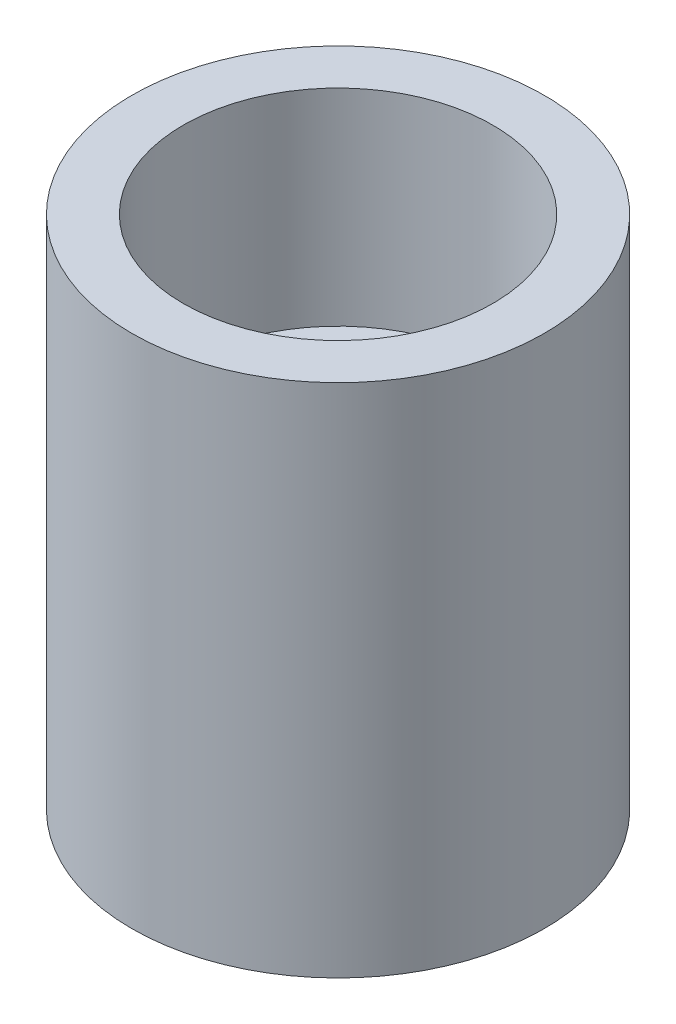
ISO-10303-21;
HEADER;
FILE_DESCRIPTION(('STEP AP214'),'2;1');
FILE_NAME('part.step','',(''),(''),'','','');
FILE_SCHEMA(('AUTOMOTIVE_DESIGN { 1 0 10303 214 1 1 1 1 }'));
ENDSEC;
DATA;
#1=APPLICATION_CONTEXT('core data for automotive mechanical design processes');
#2=APPLICATION_PROTOCOL_DEFINITION('international standard','automotive_design',2000,#1);
#3=PRODUCT_CONTEXT('',#1,'mechanical');
#4=PRODUCT('Part','Part','',(#3));
#5=PRODUCT_RELATED_PRODUCT_CATEGORY('part','',(#4));
#6=PRODUCT_DEFINITION_FORMATION('','',#4);
#7=PRODUCT_DEFINITION_CONTEXT('part definition',#1,'design');
#8=PRODUCT_DEFINITION('design','',#6,#7);
#9=PRODUCT_DEFINITION_SHAPE('','',#8);
#10=(LENGTH_UNIT() NAMED_UNIT(*) SI_UNIT(.MILLI.,.METRE.));
#11=(NAMED_UNIT(*) PLANE_ANGLE_UNIT() SI_UNIT($,.RADIAN.));
#12=(NAMED_UNIT(*) SI_UNIT($,.STERADIAN.) SOLID_ANGLE_UNIT());
#13=UNCERTAINTY_MEASURE_WITH_UNIT(LENGTH_MEASURE(1.E-05),#10,'distance_accuracy_value','');
#14=(GEOMETRIC_REPRESENTATION_CONTEXT(3) GLOBAL_UNCERTAINTY_ASSIGNED_CONTEXT((#13)) GLOBAL_UNIT_ASSIGNED_CONTEXT((#10,
#11,#12)) REPRESENTATION_CONTEXT('',''));
#15=CARTESIAN_POINT('',(0.,0.,0.));
#16=DIRECTION('',(0.,0.,1.));
#17=DIRECTION('',(1.,0.,0.));
#18=AXIS2_PLACEMENT_3D('',#15,#16,#17);
#19=CARTESIAN_POINT('',(0.,5.,0.));
#20=DIRECTION('',(0.,-1.,0.));
#21=DIRECTION('',(0.,0.,-1.));
#22=AXIS2_PLACEMENT_3D('',#19,#20,#21);
#23=CYLINDRICAL_SURFACE('',#22,2.);
#24=CARTESIAN_POINT('',(0.,5.,0.));
#25=DIRECTION('',(0.,1.,0.));
#26=DIRECTION('',(0.,0.,1.));
#27=AXIS2_PLACEMENT_3D('',#24,#25,#26);
#28=CIRCLE('',#27,2.);
#29=CARTESIAN_POINT('',(0.,5.,2.));
#30=VERTEX_POINT('',#29);
#31=EDGE_CURVE('E10',#30,#30,#28,.T.);
#32=ORIENTED_EDGE('',*,*,#31,.F.);
#33=EDGE_LOOP('',(#32));
#34=FACE_BOUND('',#33,.T.);
#35=CARTESIAN_POINT('',(0.,0.,0.));
#36=DIRECTION('',(0.,1.,0.));
#37=DIRECTION('',(0.,0.,1.));
#38=AXIS2_PLACEMENT_3D('',#35,#36,#37);
#39=CIRCLE('',#38,2.);
#40=CARTESIAN_POINT('',(0.,0.,2.));
#41=VERTEX_POINT('',#40);
#42=EDGE_CURVE('E35',#41,#41,#39,.T.);
#43=ORIENTED_EDGE('',*,*,#42,.T.);
#44=EDGE_LOOP('',(#43));
#45=FACE_BOUND('',#44,.T.);
#46=ADVANCED_FACE('F32',(#34,#45),#23,.T.);
#47=CARTESIAN_POINT('',(0.,5.,0.));
#48=DIRECTION('',(0.,1.,0.));
#49=DIRECTION('',(0.,0.,1.));
#50=AXIS2_PLACEMENT_3D('',#47,#48,#49);
#51=PLANE('',#50);
#52=CARTESIAN_POINT('',(0.,5.,0.));
#53=DIRECTION('',(0.,1.,0.));
#54=DIRECTION('',(0.,0.,1.));
#55=AXIS2_PLACEMENT_3D('',#52,#53,#54);
#56=CIRCLE('',#55,1.5);
#57=CARTESIAN_POINT('',(0.,5.,1.5));
#58=VERTEX_POINT('',#57);
#59=EDGE_CURVE('E44',#58,#58,#56,.T.);
#60=ORIENTED_EDGE('',*,*,#59,.F.);
#61=EDGE_LOOP('',(#60));
#62=FACE_BOUND('',#61,.T.);
#63=ORIENTED_EDGE('',*,*,#31,.T.);
#64=EDGE_LOOP('',(#63));
#65=FACE_BOUND('',#64,.T.);
#66=ADVANCED_FACE('F59',(#62,#65),#51,.T.);
#67=CARTESIAN_POINT('',(0.,0.,0.));
#68=DIRECTION('',(0.,1.,0.));
#69=DIRECTION('',(0.,0.,1.));
#70=AXIS2_PLACEMENT_3D('',#67,#68,#69);
#71=PLANE('',#70);
#72=ORIENTED_EDGE('',*,*,#42,.F.);
#73=EDGE_LOOP('',(#72));
#74=FACE_BOUND('',#73,.T.);
#75=ADVANCED_FACE('F55',(#74),#71,.F.);
#76=CARTESIAN_POINT('',(0.,3.,0.));
#77=DIRECTION('',(0.,1.,0.));
#78=DIRECTION('',(0.,0.,1.));
#79=AXIS2_PLACEMENT_3D('',#76,#77,#78);
#80=CYLINDRICAL_SURFACE('',#79,1.5);
#81=CARTESIAN_POINT('',(0.,3.,0.));
#82=DIRECTION('',(0.,1.,0.));
#83=DIRECTION('',(0.,0.,1.));
#84=AXIS2_PLACEMENT_3D('',#81,#82,#83);
#85=CIRCLE('',#84,1.5);
#86=CARTESIAN_POINT('',(0.,3.,1.5));
#87=VERTEX_POINT('',#86);
#88=EDGE_CURVE('E42',#87,#87,#85,.T.);
#89=ORIENTED_EDGE('',*,*,#88,.F.);
#90=EDGE_LOOP('',(#89));
#91=FACE_BOUND('',#90,.T.);
#92=ORIENTED_EDGE('',*,*,#59,.T.);
#93=EDGE_LOOP('',(#92));
#94=FACE_BOUND('',#93,.T.);
#95=ADVANCED_FACE('F52',(#91,#94),#80,.F.);
#96=CARTESIAN_POINT('',(0.,3.,0.));
#97=DIRECTION('',(0.,1.,0.));
#98=DIRECTION('',(0.,0.,1.));
#99=AXIS2_PLACEMENT_3D('',#96,#97,#98);
#100=PLANE('',#99);
#101=ORIENTED_EDGE('',*,*,#88,.T.);
#102=EDGE_LOOP('',(#101));
#103=FACE_BOUND('',#102,.T.);
#104=ADVANCED_FACE('F50',(#103),#100,.T.);
#105=CLOSED_SHELL('',(#46,#66,#75,#95,#104));
#106=MANIFOLD_SOLID_BREP('B2',#105);
#107=ADVANCED_BREP_SHAPE_REPRESENTATION('',(#18,#106),#14);
#108=SHAPE_DEFINITION_REPRESENTATION(#9,#107);
ENDSEC;
END-ISO-10303-21;
